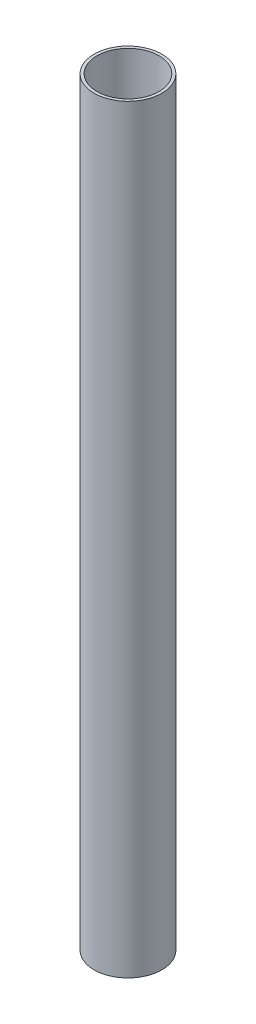
ISO-10303-21;
HEADER;
FILE_DESCRIPTION(('STEP AP214'),'2;1');
FILE_NAME('part.step','',(''),(''),'','','');
FILE_SCHEMA(('AUTOMOTIVE_DESIGN { 1 0 10303 214 1 1 1 1 }'));
ENDSEC;
DATA;
#1=APPLICATION_CONTEXT('core data for automotive mechanical design processes');
#2=APPLICATION_PROTOCOL_DEFINITION('international standard','automotive_design',2000,#1);
#3=PRODUCT_CONTEXT('',#1,'mechanical');
#4=PRODUCT('Part','Part','',(#3));
#5=PRODUCT_RELATED_PRODUCT_CATEGORY('part','',(#4));
#6=PRODUCT_DEFINITION_FORMATION('','',#4);
#7=PRODUCT_DEFINITION_CONTEXT('part definition',#1,'design');
#8=PRODUCT_DEFINITION('design','',#6,#7);
#9=PRODUCT_DEFINITION_SHAPE('','',#8);
#10=(LENGTH_UNIT() NAMED_UNIT(*) SI_UNIT(.MILLI.,.METRE.));
#11=(NAMED_UNIT(*) PLANE_ANGLE_UNIT() SI_UNIT($,.RADIAN.));
#12=(NAMED_UNIT(*) SI_UNIT($,.STERADIAN.) SOLID_ANGLE_UNIT());
#13=UNCERTAINTY_MEASURE_WITH_UNIT(LENGTH_MEASURE(1.E-05),#10,'distance_accuracy_value','');
#14=(GEOMETRIC_REPRESENTATION_CONTEXT(3) GLOBAL_UNCERTAINTY_ASSIGNED_CONTEXT((#13)) GLOBAL_UNIT_ASSIGNED_CONTEXT((#10,
#11,#12)) REPRESENTATION_CONTEXT('',''));
#15=CARTESIAN_POINT('',(0.,0.,0.));
#16=DIRECTION('',(0.,0.,1.));
#17=DIRECTION('',(1.,0.,0.));
#18=AXIS2_PLACEMENT_3D('',#15,#16,#17);
#19=CARTESIAN_POINT('',(0.,330.2,0.));
#20=DIRECTION('',(0.,-1.,0.));
#21=DIRECTION('',(0.,0.,-1.));
#22=AXIS2_PLACEMENT_3D('',#19,#20,#21);
#23=CYLINDRICAL_SURFACE('',#22,14.732);
#24=CARTESIAN_POINT('',(0.,330.2,0.));
#25=DIRECTION('',(0.,1.,0.));
#26=DIRECTION('',(0.,0.,1.));
#27=AXIS2_PLACEMENT_3D('',#24,#25,#26);
#28=CIRCLE('',#27,14.732);
#29=CARTESIAN_POINT('',(0.,330.2,14.732));
#30=VERTEX_POINT('',#29);
#31=EDGE_CURVE('E10',#30,#30,#28,.T.);
#32=ORIENTED_EDGE('',*,*,#31,.F.);
#33=EDGE_LOOP('',(#32));
#34=FACE_BOUND('',#33,.T.);
#35=CARTESIAN_POINT('',(0.,0.,0.));
#36=DIRECTION('',(0.,1.,0.));
#37=DIRECTION('',(0.,0.,1.));
#38=AXIS2_PLACEMENT_3D('',#35,#36,#37);
#39=CIRCLE('',#38,14.732);
#40=CARTESIAN_POINT('',(0.,0.,14.732));
#41=VERTEX_POINT('',#40);
#42=EDGE_CURVE('E44',#41,#41,#39,.T.);
#43=ORIENTED_EDGE('',*,*,#42,.T.);
#44=EDGE_LOOP('',(#43));
#45=FACE_BOUND('',#44,.T.);
#46=ADVANCED_FACE('F41',(#34,#45),#23,.T.);
#47=CARTESIAN_POINT('',(0.,330.2,0.));
#48=DIRECTION('',(0.,1.,0.));
#49=DIRECTION('',(0.,0.,1.));
#50=AXIS2_PLACEMENT_3D('',#47,#48,#49);
#51=PLANE('',#50);
#52=CARTESIAN_POINT('',(0.,330.2,0.));
#53=DIRECTION('',(0.,1.,0.));
#54=DIRECTION('',(0.,0.,1.));
#55=AXIS2_PLACEMENT_3D('',#52,#53,#54);
#56=CIRCLE('',#55,13.4943666060426);
#57=CARTESIAN_POINT('',(0.,330.2,13.4943666060426));
#58=VERTEX_POINT('',#57);
#59=EDGE_CURVE('E55',#58,#58,#56,.T.);
#60=ORIENTED_EDGE('',*,*,#59,.F.);
#61=EDGE_LOOP('',(#60));
#62=FACE_BOUND('',#61,.T.);
#63=ORIENTED_EDGE('',*,*,#31,.T.);
#64=EDGE_LOOP('',(#63));
#65=FACE_BOUND('',#64,.T.);
#66=ADVANCED_FACE('F72',(#62,#65),#51,.T.);
#67=CARTESIAN_POINT('',(0.,0.,0.));
#68=DIRECTION('',(0.,1.,0.));
#69=DIRECTION('',(0.,0.,1.));
#70=AXIS2_PLACEMENT_3D('',#67,#68,#69);
#71=PLANE('',#70);
#72=CARTESIAN_POINT('',(0.,0.,0.));
#73=DIRECTION('',(0.,1.,0.));
#74=DIRECTION('',(0.,0.,1.));
#75=AXIS2_PLACEMENT_3D('',#72,#73,#74);
#76=CIRCLE('',#75,13.4943666060426);
#77=CARTESIAN_POINT('',(0.,0.,13.4943666060426));
#78=VERTEX_POINT('',#77);
#79=EDGE_CURVE('E53',#78,#78,#76,.T.);
#80=ORIENTED_EDGE('',*,*,#79,.T.);
#81=EDGE_LOOP('',(#80));
#82=FACE_BOUND('',#81,.T.);
#83=ORIENTED_EDGE('',*,*,#42,.F.);
#84=EDGE_LOOP('',(#83));
#85=FACE_BOUND('',#84,.T.);
#86=ADVANCED_FACE('F63',(#82,#85),#71,.F.);
#87=CARTESIAN_POINT('',(0.,0.,0.));
#88=DIRECTION('',(0.,1.,0.));
#89=DIRECTION('',(0.,0.,1.));
#90=AXIS2_PLACEMENT_3D('',#87,#88,#89);
#91=CYLINDRICAL_SURFACE('',#90,13.4943666060426);
#92=ORIENTED_EDGE('',*,*,#79,.F.);
#93=EDGE_LOOP('',(#92));
#94=FACE_BOUND('',#93,.T.);
#95=ORIENTED_EDGE('',*,*,#59,.T.);
#96=EDGE_LOOP('',(#95));
#97=FACE_BOUND('',#96,.T.);
#98=ADVANCED_FACE('F66',(#94,#97),#91,.F.);
#99=CLOSED_SHELL('',(#46,#66,#86,#98));
#100=MANIFOLD_SOLID_BREP('B2',#99);
#101=ADVANCED_BREP_SHAPE_REPRESENTATION('',(#18,#100),#14);
#102=SHAPE_DEFINITION_REPRESENTATION(#9,#101);
ENDSEC;
END-ISO-10303-21;
